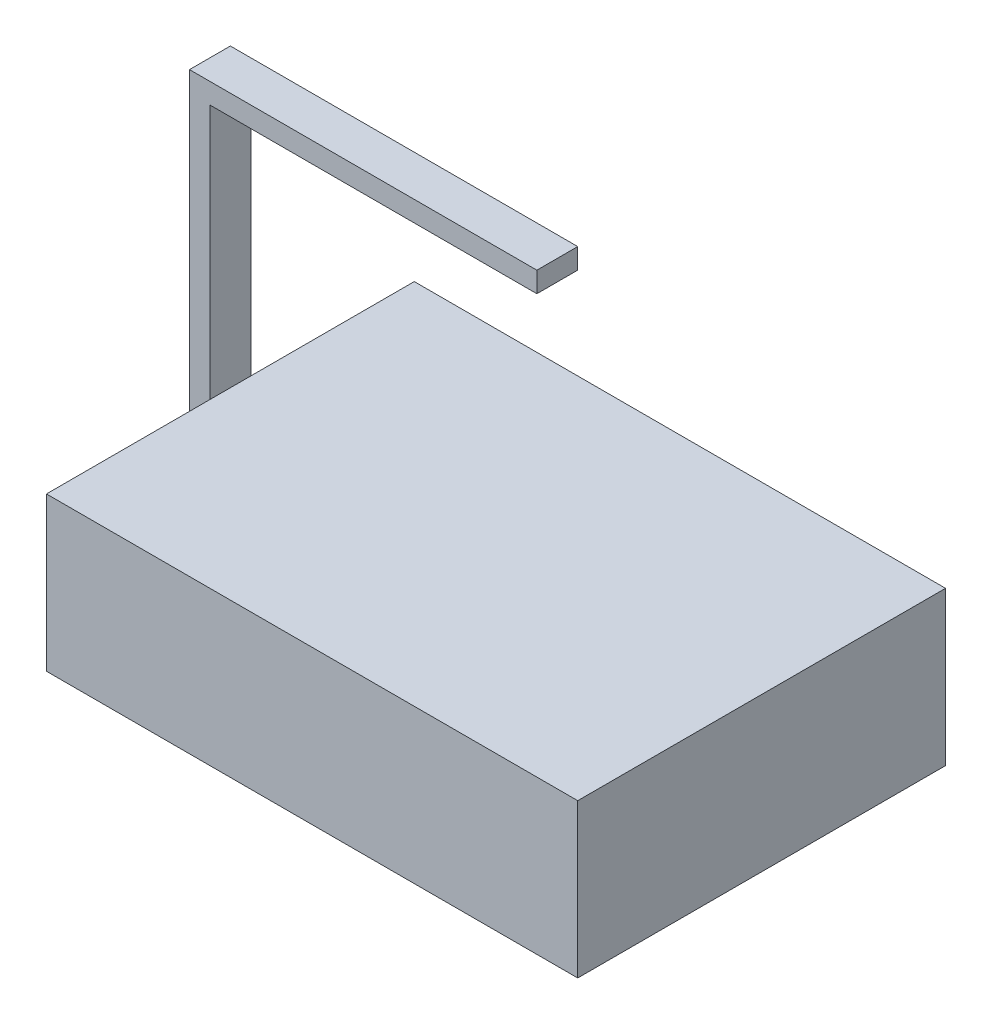
ISO-10303-21;
HEADER;
FILE_DESCRIPTION(('STEP AP214'),'2;1');
FILE_NAME('part.step','',(''),(''),'','','');
FILE_SCHEMA(('AUTOMOTIVE_DESIGN { 1 0 10303 214 1 1 1 1 }'));
ENDSEC;
DATA;
#1=APPLICATION_CONTEXT('core data for automotive mechanical design processes');
#2=APPLICATION_PROTOCOL_DEFINITION('international standard','automotive_design',2000,#1);
#3=PRODUCT_CONTEXT('',#1,'mechanical');
#4=PRODUCT('Part','Part','',(#3));
#5=PRODUCT_RELATED_PRODUCT_CATEGORY('part','',(#4));
#6=PRODUCT_DEFINITION_FORMATION('','',#4);
#7=PRODUCT_DEFINITION_CONTEXT('part definition',#1,'design');
#8=PRODUCT_DEFINITION('design','',#6,#7);
#9=PRODUCT_DEFINITION_SHAPE('','',#8);
#10=(LENGTH_UNIT() NAMED_UNIT(*) SI_UNIT(.MILLI.,.METRE.));
#11=(NAMED_UNIT(*) PLANE_ANGLE_UNIT() SI_UNIT($,.RADIAN.));
#12=(NAMED_UNIT(*) SI_UNIT($,.STERADIAN.) SOLID_ANGLE_UNIT());
#13=UNCERTAINTY_MEASURE_WITH_UNIT(LENGTH_MEASURE(1.E-05),#10,'distance_accuracy_value','');
#14=(GEOMETRIC_REPRESENTATION_CONTEXT(3) GLOBAL_UNCERTAINTY_ASSIGNED_CONTEXT((#13)) GLOBAL_UNIT_ASSIGNED_CONTEXT((#10,
#11,#12)) REPRESENTATION_CONTEXT('',''));
#15=CARTESIAN_POINT('',(0.,0.,0.));
#16=DIRECTION('',(0.,0.,1.));
#17=DIRECTION('',(1.,0.,0.));
#18=AXIS2_PLACEMENT_3D('',#15,#16,#17);
#19=CARTESIAN_POINT('',(0.,37.58,0.));
#20=DIRECTION('',(1.,0.,0.));
#21=DIRECTION('',(0.,0.,-1.));
#22=AXIS2_PLACEMENT_3D('',#19,#20,#21);
#23=PLANE('',#22);
#24=DIRECTION('',(0.,-1.,0.));
#25=VECTOR('',#24,1.);
#26=CARTESIAN_POINT('',(0.,0.,40.));
#27=LINE('',#26,#25);
#28=CARTESIAN_POINT('',(0.,37.58,40.));
#29=VERTEX_POINT('',#28);
#30=CARTESIAN_POINT('',(0.,0.,40.));
#31=VERTEX_POINT('',#30);
#32=EDGE_CURVE('E11',#29,#31,#27,.T.);
#33=ORIENTED_EDGE('',*,*,#32,.F.);
#34=DIRECTION('',(0.,0.,1.));
#35=VECTOR('',#34,1.);
#36=CARTESIAN_POINT('',(0.,37.58,0.));
#37=LINE('',#36,#35);
#38=CARTESIAN_POINT('',(0.,37.58,0.));
#39=VERTEX_POINT('',#38);
#40=EDGE_CURVE('E171',#39,#29,#37,.T.);
#41=ORIENTED_EDGE('',*,*,#40,.F.);
#42=DIRECTION('',(0.,-1.,0.));
#43=VECTOR('',#42,1.);
#44=CARTESIAN_POINT('',(0.,37.58,0.));
#45=LINE('',#44,#43);
#46=CARTESIAN_POINT('',(0.,0.,0.));
#47=VERTEX_POINT('',#46);
#48=EDGE_CURVE('E181',#39,#47,#45,.T.);
#49=ORIENTED_EDGE('',*,*,#48,.T.);
#50=DIRECTION('',(0.,0.,1.));
#51=VECTOR('',#50,1.);
#52=CARTESIAN_POINT('',(0.,0.,0.));
#53=LINE('',#52,#51);
#54=EDGE_CURVE('E182',#47,#31,#53,.T.);
#55=ORIENTED_EDGE('',*,*,#54,.T.);
#56=EDGE_LOOP('',(#33,#41,#49,#55));
#57=FACE_BOUND('',#56,.T.);
#58=ADVANCED_FACE('F33',(#57),#23,.F.);
#59=DIRECTION('',(0.,1.,0.));
#60=VECTOR('',#59,1.);
#61=CARTESIAN_POINT('',(0.,0.,50.));
#62=LINE('',#61,#60);
#63=CARTESIAN_POINT('',(0.,0.,50.));
#64=VERTEX_POINT('',#63);
#65=CARTESIAN_POINT('',(0.,37.58,50.));
#66=VERTEX_POINT('',#65);
#67=EDGE_CURVE('E55',#64,#66,#62,.T.);
#68=ORIENTED_EDGE('',*,*,#67,.F.);
#69=CARTESIAN_POINT('',(0.,0.,90.));
#70=VERTEX_POINT('',#69);
#71=EDGE_CURVE('E170',#64,#70,#53,.T.);
#72=ORIENTED_EDGE('',*,*,#71,.T.);
#73=DIRECTION('',(0.,-1.,0.));
#74=VECTOR('',#73,1.);
#75=CARTESIAN_POINT('',(0.,37.58,90.));
#76=LINE('',#75,#74);
#77=CARTESIAN_POINT('',(0.,37.58,90.));
#78=VERTEX_POINT('',#77);
#79=EDGE_CURVE('E36',#78,#70,#76,.T.);
#80=ORIENTED_EDGE('',*,*,#79,.F.);
#81=EDGE_CURVE('E175',#66,#78,#37,.T.);
#82=ORIENTED_EDGE('',*,*,#81,.F.);
#83=EDGE_LOOP('',(#68,#72,#80,#82));
#84=FACE_BOUND('',#83,.T.);
#85=ADVANCED_FACE('F206',(#84),#23,.F.);
#86=CARTESIAN_POINT('',(0.,37.58,90.));
#87=DIRECTION('',(0.,0.,-1.));
#88=DIRECTION('',(-1.,0.,0.));
#89=AXIS2_PLACEMENT_3D('',#86,#87,#88);
#90=PLANE('',#89);
#91=DIRECTION('',(1.,0.,0.));
#92=VECTOR('',#91,1.);
#93=CARTESIAN_POINT('',(0.,0.,90.));
#94=LINE('',#93,#92);
#95=CARTESIAN_POINT('',(130.,0.,90.));
#96=VERTEX_POINT('',#95);
#97=EDGE_CURVE('E184',#70,#96,#94,.T.);
#98=ORIENTED_EDGE('',*,*,#97,.T.);
#99=DIRECTION('',(0.,-1.,0.));
#100=VECTOR('',#99,1.);
#101=CARTESIAN_POINT('',(130.,37.58,90.));
#102=LINE('',#101,#100);
#103=CARTESIAN_POINT('',(130.,37.58,90.));
#104=VERTEX_POINT('',#103);
#105=EDGE_CURVE('E194',#104,#96,#102,.T.);
#106=ORIENTED_EDGE('',*,*,#105,.F.);
#107=DIRECTION('',(1.,0.,0.));
#108=VECTOR('',#107,1.);
#109=CARTESIAN_POINT('',(0.,37.58,90.));
#110=LINE('',#109,#108);
#111=EDGE_CURVE('E173',#78,#104,#110,.T.);
#112=ORIENTED_EDGE('',*,*,#111,.F.);
#113=ORIENTED_EDGE('',*,*,#79,.T.);
#114=EDGE_LOOP('',(#98,#106,#112,#113));
#115=FACE_BOUND('',#114,.T.);
#116=ADVANCED_FACE('F204',(#115),#90,.F.);
#117=CARTESIAN_POINT('',(130.,37.58,0.));
#118=DIRECTION('',(-1.,0.,0.));
#119=DIRECTION('',(0.,0.,1.));
#120=AXIS2_PLACEMENT_3D('',#117,#118,#119);
#121=PLANE('',#120);
#122=DIRECTION('',(0.,0.,-1.));
#123=VECTOR('',#122,1.);
#124=CARTESIAN_POINT('',(130.,0.,0.));
#125=LINE('',#124,#123);
#126=CARTESIAN_POINT('',(130.,0.,0.));
#127=VERTEX_POINT('',#126);
#128=EDGE_CURVE('E186',#96,#127,#125,.T.);
#129=ORIENTED_EDGE('',*,*,#128,.T.);
#130=DIRECTION('',(0.,-1.,0.));
#131=VECTOR('',#130,1.);
#132=CARTESIAN_POINT('',(130.,37.58,0.));
#133=LINE('',#132,#131);
#134=CARTESIAN_POINT('',(130.,37.58,0.));
#135=VERTEX_POINT('',#134);
#136=EDGE_CURVE('E192',#135,#127,#133,.T.);
#137=ORIENTED_EDGE('',*,*,#136,.F.);
#138=DIRECTION('',(0.,0.,-1.));
#139=VECTOR('',#138,1.);
#140=CARTESIAN_POINT('',(130.,37.58,0.));
#141=LINE('',#140,#139);
#142=EDGE_CURVE('E177',#104,#135,#141,.T.);
#143=ORIENTED_EDGE('',*,*,#142,.F.);
#144=ORIENTED_EDGE('',*,*,#105,.T.);
#145=EDGE_LOOP('',(#129,#137,#143,#144));
#146=FACE_BOUND('',#145,.T.);
#147=ADVANCED_FACE('F213',(#146),#121,.F.);
#148=CARTESIAN_POINT('',(0.,37.58,0.));
#149=DIRECTION('',(0.,0.,1.));
#150=DIRECTION('',(1.,0.,0.));
#151=AXIS2_PLACEMENT_3D('',#148,#149,#150);
#152=PLANE('',#151);
#153=DIRECTION('',(-1.,0.,0.));
#154=VECTOR('',#153,1.);
#155=CARTESIAN_POINT('',(0.,0.,0.));
#156=LINE('',#155,#154);
#157=EDGE_CURVE('E188',#127,#47,#156,.T.);
#158=ORIENTED_EDGE('',*,*,#157,.T.);
#159=ORIENTED_EDGE('',*,*,#48,.F.);
#160=DIRECTION('',(-1.,0.,0.));
#161=VECTOR('',#160,1.);
#162=CARTESIAN_POINT('',(0.,37.58,0.));
#163=LINE('',#162,#161);
#164=EDGE_CURVE('E179',#135,#39,#163,.T.);
#165=ORIENTED_EDGE('',*,*,#164,.F.);
#166=ORIENTED_EDGE('',*,*,#136,.T.);
#167=EDGE_LOOP('',(#158,#159,#165,#166));
#168=FACE_BOUND('',#167,.T.);
#169=ADVANCED_FACE('F216',(#168),#152,.F.);
#170=CARTESIAN_POINT('',(0.,37.58,0.));
#171=DIRECTION('',(0.,1.,0.));
#172=DIRECTION('',(0.,0.,1.));
#173=AXIS2_PLACEMENT_3D('',#170,#171,#172);
#174=PLANE('',#173);
#175=ORIENTED_EDGE('',*,*,#40,.T.);
#176=EDGE_CURVE('E174',#29,#66,#37,.T.);
#177=ORIENTED_EDGE('',*,*,#176,.T.);
#178=ORIENTED_EDGE('',*,*,#81,.T.);
#179=ORIENTED_EDGE('',*,*,#111,.T.);
#180=ORIENTED_EDGE('',*,*,#142,.T.);
#181=ORIENTED_EDGE('',*,*,#164,.T.);
#182=EDGE_LOOP('',(#175,#177,#178,#179,#180,#181));
#183=FACE_BOUND('',#182,.T.);
#184=ADVANCED_FACE('F219',(#183),#174,.T.);
#185=CARTESIAN_POINT('',(0.,0.,0.));
#186=DIRECTION('',(0.,1.,0.));
#187=DIRECTION('',(0.,0.,1.));
#188=AXIS2_PLACEMENT_3D('',#185,#186,#187);
#189=PLANE('',#188);
#190=ORIENTED_EDGE('',*,*,#54,.F.);
#191=ORIENTED_EDGE('',*,*,#157,.F.);
#192=ORIENTED_EDGE('',*,*,#128,.F.);
#193=ORIENTED_EDGE('',*,*,#97,.F.);
#194=ORIENTED_EDGE('',*,*,#71,.F.);
#195=DIRECTION('',(1.,0.,0.));
#196=VECTOR('',#195,1.);
#197=CARTESIAN_POINT('',(-5.,0.,50.));
#198=LINE('',#197,#196);
#199=CARTESIAN_POINT('',(-5.,0.,50.));
#200=VERTEX_POINT('',#199);
#201=EDGE_CURVE('E127',#200,#64,#198,.T.);
#202=ORIENTED_EDGE('',*,*,#201,.F.);
#203=DIRECTION('',(0.,0.,1.));
#204=VECTOR('',#203,1.);
#205=CARTESIAN_POINT('',(-5.,0.,40.));
#206=LINE('',#205,#204);
#207=CARTESIAN_POINT('',(-5.,0.,40.));
#208=VERTEX_POINT('',#207);
#209=EDGE_CURVE('E123',#208,#200,#206,.T.);
#210=ORIENTED_EDGE('',*,*,#209,.F.);
#211=DIRECTION('',(1.,0.,0.));
#212=VECTOR('',#211,1.);
#213=CARTESIAN_POINT('',(-5.,0.,40.));
#214=LINE('',#213,#212);
#215=EDGE_CURVE('E167',#208,#31,#214,.T.);
#216=ORIENTED_EDGE('',*,*,#215,.T.);
#217=EDGE_LOOP('',(#190,#191,#192,#193,#194,#202,#210,#216));
#218=FACE_BOUND('',#217,.T.);
#219=ADVANCED_FACE('F210',(#218),#189,.F.);
#220=CARTESIAN_POINT('',(0.,0.,0.));
#221=DIRECTION('',(1.,0.,0.));
#222=DIRECTION('',(0.,0.,-1.));
#223=AXIS2_PLACEMENT_3D('',#220,#221,#222);
#224=PLANE('',#223);
#225=ORIENTED_EDGE('',*,*,#176,.F.);
#226=CARTESIAN_POINT('',(0.,100.,40.));
#227=VERTEX_POINT('',#226);
#228=EDGE_CURVE('E42',#227,#29,#27,.T.);
#229=ORIENTED_EDGE('',*,*,#228,.F.);
#230=DIRECTION('',(0.,0.,-1.));
#231=VECTOR('',#230,1.);
#232=CARTESIAN_POINT('',(0.,100.,40.));
#233=LINE('',#232,#231);
#234=CARTESIAN_POINT('',(0.,100.,50.));
#235=VERTEX_POINT('',#234);
#236=EDGE_CURVE('E159',#235,#227,#233,.T.);
#237=ORIENTED_EDGE('',*,*,#236,.F.);
#238=EDGE_CURVE('E162',#66,#235,#62,.T.);
#239=ORIENTED_EDGE('',*,*,#238,.F.);
#240=EDGE_LOOP('',(#225,#229,#237,#239));
#241=FACE_BOUND('',#240,.T.);
#242=ADVANCED_FACE('F222',(#241),#224,.T.);
#243=CARTESIAN_POINT('',(-5.,0.,40.));
#244=DIRECTION('',(0.,0.,1.));
#245=DIRECTION('',(1.,0.,0.));
#246=AXIS2_PLACEMENT_3D('',#243,#244,#245);
#247=PLANE('',#246);
#248=ORIENTED_EDGE('',*,*,#228,.T.);
#249=ORIENTED_EDGE('',*,*,#32,.T.);
#250=ORIENTED_EDGE('',*,*,#215,.F.);
#251=DIRECTION('',(0.,-1.,0.));
#252=VECTOR('',#251,1.);
#253=CARTESIAN_POINT('',(-5.,0.,40.));
#254=LINE('',#253,#252);
#255=CARTESIAN_POINT('',(-5.,105.,40.));
#256=VERTEX_POINT('',#255);
#257=EDGE_CURVE('E157',#256,#208,#254,.T.);
#258=ORIENTED_EDGE('',*,*,#257,.F.);
#259=DIRECTION('',(-1.,0.,0.));
#260=VECTOR('',#259,1.);
#261=CARTESIAN_POINT('',(-5.,105.,40.));
#262=LINE('',#261,#260);
#263=CARTESIAN_POINT('',(80.,105.,40.));
#264=VERTEX_POINT('',#263);
#265=EDGE_CURVE('E141',#264,#256,#262,.T.);
#266=ORIENTED_EDGE('',*,*,#265,.F.);
#267=DIRECTION('',(0.,-1.,0.));
#268=VECTOR('',#267,1.);
#269=CARTESIAN_POINT('',(80.,105.,40.));
#270=LINE('',#269,#268);
#271=CARTESIAN_POINT('',(80.,100.,40.));
#272=VERTEX_POINT('',#271);
#273=EDGE_CURVE('E150',#264,#272,#270,.T.);
#274=ORIENTED_EDGE('',*,*,#273,.T.);
#275=DIRECTION('',(-1.,0.,0.));
#276=VECTOR('',#275,1.);
#277=CARTESIAN_POINT('',(-5.,100.,40.));
#278=LINE('',#277,#276);
#279=EDGE_CURVE('E142',#272,#227,#278,.T.);
#280=ORIENTED_EDGE('',*,*,#279,.T.);
#281=EDGE_LOOP('',(#248,#249,#250,#258,#266,#274,#280));
#282=FACE_BOUND('',#281,.T.);
#283=ADVANCED_FACE('F225',(#282),#247,.F.);
#284=CARTESIAN_POINT('',(-5.,0.,50.));
#285=DIRECTION('',(0.,0.,-1.));
#286=DIRECTION('',(0.,1.,0.));
#287=AXIS2_PLACEMENT_3D('',#284,#285,#286);
#288=PLANE('',#287);
#289=ORIENTED_EDGE('',*,*,#67,.T.);
#290=ORIENTED_EDGE('',*,*,#238,.T.);
#291=DIRECTION('',(1.,0.,0.));
#292=VECTOR('',#291,1.);
#293=CARTESIAN_POINT('',(-5.,100.,50.));
#294=LINE('',#293,#292);
#295=CARTESIAN_POINT('',(80.,100.,50.));
#296=VERTEX_POINT('',#295);
#297=EDGE_CURVE('E151',#235,#296,#294,.T.);
#298=ORIENTED_EDGE('',*,*,#297,.T.);
#299=DIRECTION('',(0.,-1.,0.));
#300=VECTOR('',#299,1.);
#301=CARTESIAN_POINT('',(80.,105.,50.));
#302=LINE('',#301,#300);
#303=CARTESIAN_POINT('',(80.,105.,50.));
#304=VERTEX_POINT('',#303);
#305=EDGE_CURVE('E133',#304,#296,#302,.T.);
#306=ORIENTED_EDGE('',*,*,#305,.F.);
#307=DIRECTION('',(1.,0.,0.));
#308=VECTOR('',#307,1.);
#309=CARTESIAN_POINT('',(-5.,105.,50.));
#310=LINE('',#309,#308);
#311=CARTESIAN_POINT('',(-5.,105.,50.));
#312=VERTEX_POINT('',#311);
#313=EDGE_CURVE('E130',#312,#304,#310,.T.);
#314=ORIENTED_EDGE('',*,*,#313,.F.);
#315=DIRECTION('',(0.,1.,0.));
#316=VECTOR('',#315,1.);
#317=CARTESIAN_POINT('',(-5.,0.,50.));
#318=LINE('',#317,#316);
#319=EDGE_CURVE('E117',#200,#312,#318,.T.);
#320=ORIENTED_EDGE('',*,*,#319,.F.);
#321=ORIENTED_EDGE('',*,*,#201,.T.);
#322=EDGE_LOOP('',(#289,#290,#298,#306,#314,#320,#321));
#323=FACE_BOUND('',#322,.T.);
#324=ADVANCED_FACE('F131',(#323),#288,.F.);
#325=CARTESIAN_POINT('',(-5.,0.,0.));
#326=DIRECTION('',(1.,0.,0.));
#327=DIRECTION('',(0.,0.,-1.));
#328=AXIS2_PLACEMENT_3D('',#325,#326,#327);
#329=PLANE('',#328);
#330=ORIENTED_EDGE('',*,*,#257,.T.);
#331=ORIENTED_EDGE('',*,*,#209,.T.);
#332=ORIENTED_EDGE('',*,*,#319,.T.);
#333=DIRECTION('',(0.,0.,1.));
#334=VECTOR('',#333,1.);
#335=CARTESIAN_POINT('',(-5.,105.,40.));
#336=LINE('',#335,#334);
#337=EDGE_CURVE('E122',#256,#312,#336,.T.);
#338=ORIENTED_EDGE('',*,*,#337,.F.);
#339=EDGE_LOOP('',(#330,#331,#332,#338));
#340=FACE_BOUND('',#339,.T.);
#341=ADVANCED_FACE('F120',(#340),#329,.F.);
#342=CARTESIAN_POINT('',(0.,100.,0.));
#343=DIRECTION('',(0.,1.,0.));
#344=DIRECTION('',(0.,0.,1.));
#345=AXIS2_PLACEMENT_3D('',#342,#343,#344);
#346=PLANE('',#345);
#347=ORIENTED_EDGE('',*,*,#297,.F.);
#348=ORIENTED_EDGE('',*,*,#236,.T.);
#349=ORIENTED_EDGE('',*,*,#279,.F.);
#350=DIRECTION('',(0.,0.,-1.));
#351=VECTOR('',#350,1.);
#352=CARTESIAN_POINT('',(80.,100.,40.));
#353=LINE('',#352,#351);
#354=EDGE_CURVE('E145',#296,#272,#353,.T.);
#355=ORIENTED_EDGE('',*,*,#354,.F.);
#356=EDGE_LOOP('',(#347,#348,#349,#355));
#357=FACE_BOUND('',#356,.T.);
#358=ADVANCED_FACE('F232',(#357),#346,.F.);
#359=CARTESIAN_POINT('',(80.,105.,40.));
#360=DIRECTION('',(-1.,0.,0.));
#361=DIRECTION('',(0.,0.,1.));
#362=AXIS2_PLACEMENT_3D('',#359,#360,#361);
#363=PLANE('',#362);
#364=ORIENTED_EDGE('',*,*,#354,.T.);
#365=ORIENTED_EDGE('',*,*,#273,.F.);
#366=DIRECTION('',(0.,0.,-1.));
#367=VECTOR('',#366,1.);
#368=CARTESIAN_POINT('',(80.,105.,40.));
#369=LINE('',#368,#367);
#370=EDGE_CURVE('E136',#304,#264,#369,.T.);
#371=ORIENTED_EDGE('',*,*,#370,.F.);
#372=ORIENTED_EDGE('',*,*,#305,.T.);
#373=EDGE_LOOP('',(#364,#365,#371,#372));
#374=FACE_BOUND('',#373,.T.);
#375=ADVANCED_FACE('F234',(#374),#363,.F.);
#376=CARTESIAN_POINT('',(0.,105.,0.));
#377=DIRECTION('',(0.,1.,0.));
#378=DIRECTION('',(0.,0.,1.));
#379=AXIS2_PLACEMENT_3D('',#376,#377,#378);
#380=PLANE('',#379);
#381=ORIENTED_EDGE('',*,*,#337,.T.);
#382=ORIENTED_EDGE('',*,*,#313,.T.);
#383=ORIENTED_EDGE('',*,*,#370,.T.);
#384=ORIENTED_EDGE('',*,*,#265,.T.);
#385=EDGE_LOOP('',(#381,#382,#383,#384));
#386=FACE_BOUND('',#385,.T.);
#387=ADVANCED_FACE('F139',(#386),#380,.T.);
#388=CLOSED_SHELL('',(#58,#85,#116,#147,#169,#184,#219,#242,#283,#324,#341,#358,#375,#387));
#389=MANIFOLD_SOLID_BREP('B2',#388);
#390=ADVANCED_BREP_SHAPE_REPRESENTATION('',(#18,#389),#14);
#391=SHAPE_DEFINITION_REPRESENTATION(#9,#390);
ENDSEC;
END-ISO-10303-21;
